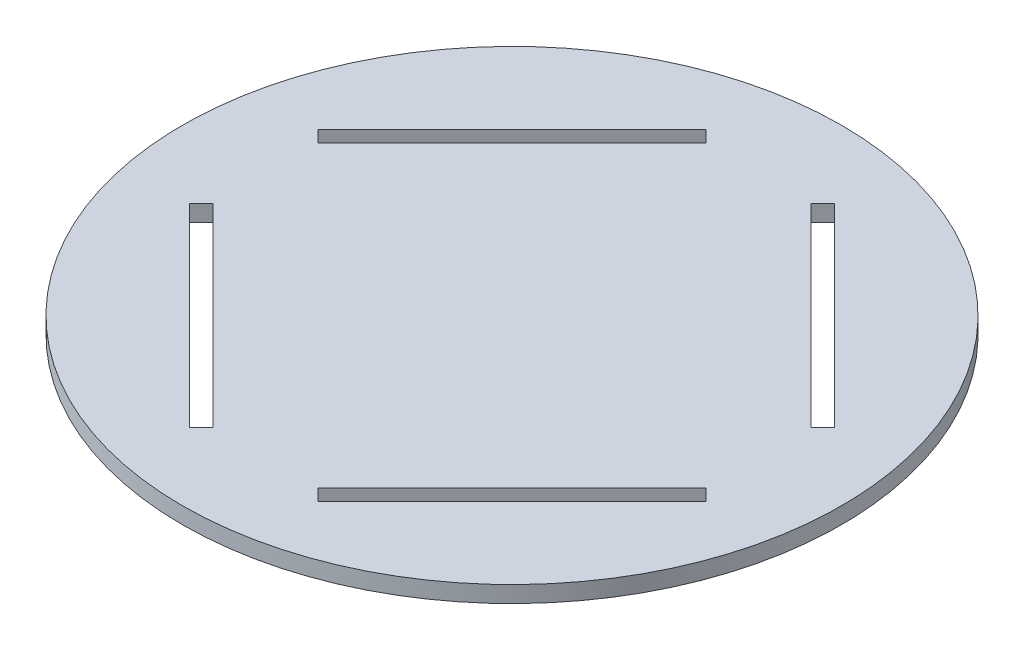
ISO-10303-21;
HEADER;
FILE_DESCRIPTION(('STEP AP214'),'2;1');
FILE_NAME('part.step','',(''),(''),'','','');
FILE_SCHEMA(('AUTOMOTIVE_DESIGN { 1 0 10303 214 1 1 1 1 }'));
ENDSEC;
DATA;
#1=APPLICATION_CONTEXT('core data for automotive mechanical design processes');
#2=APPLICATION_PROTOCOL_DEFINITION('international standard','automotive_design',2000,#1);
#3=PRODUCT_CONTEXT('',#1,'mechanical');
#4=PRODUCT('Part','Part','',(#3));
#5=PRODUCT_RELATED_PRODUCT_CATEGORY('part','',(#4));
#6=PRODUCT_DEFINITION_FORMATION('','',#4);
#7=PRODUCT_DEFINITION_CONTEXT('part definition',#1,'design');
#8=PRODUCT_DEFINITION('design','',#6,#7);
#9=PRODUCT_DEFINITION_SHAPE('','',#8);
#10=(LENGTH_UNIT() NAMED_UNIT(*) SI_UNIT(.MILLI.,.METRE.));
#11=(NAMED_UNIT(*) PLANE_ANGLE_UNIT() SI_UNIT($,.RADIAN.));
#12=(NAMED_UNIT(*) SI_UNIT($,.STERADIAN.) SOLID_ANGLE_UNIT());
#13=UNCERTAINTY_MEASURE_WITH_UNIT(LENGTH_MEASURE(1.E-05),#10,'distance_accuracy_value','');
#14=(GEOMETRIC_REPRESENTATION_CONTEXT(3) GLOBAL_UNCERTAINTY_ASSIGNED_CONTEXT((#13)) GLOBAL_UNIT_ASSIGNED_CONTEXT((#10,
#11,#12)) REPRESENTATION_CONTEXT('',''));
#15=CARTESIAN_POINT('',(0.,0.,0.));
#16=DIRECTION('',(0.,0.,1.));
#17=DIRECTION('',(1.,0.,0.));
#18=AXIS2_PLACEMENT_3D('',#15,#16,#17);
#19=CARTESIAN_POINT('',(0.,1.5,0.));
#20=DIRECTION('',(0.,-1.,0.));
#21=DIRECTION('',(0.,0.,-1.));
#22=AXIS2_PLACEMENT_3D('',#19,#20,#21);
#23=CYLINDRICAL_SURFACE('',#22,60.);
#24=CARTESIAN_POINT('',(0.,1.5,0.));
#25=DIRECTION('',(0.,1.,0.));
#26=DIRECTION('',(0.,0.,1.));
#27=AXIS2_PLACEMENT_3D('',#24,#25,#26);
#28=CIRCLE('',#27,60.);
#29=CARTESIAN_POINT('',(0.,1.5,60.));
#30=VERTEX_POINT('',#29);
#31=EDGE_CURVE('E13',#30,#30,#28,.T.);
#32=ORIENTED_EDGE('',*,*,#31,.F.);
#33=EDGE_LOOP('',(#32));
#34=FACE_BOUND('',#33,.T.);
#35=CARTESIAN_POINT('',(0.,-1.5,0.));
#36=DIRECTION('',(0.,1.,0.));
#37=DIRECTION('',(0.,0.,1.));
#38=AXIS2_PLACEMENT_3D('',#35,#36,#37);
#39=CIRCLE('',#38,60.);
#40=CARTESIAN_POINT('',(0.,-1.5,60.));
#41=VERTEX_POINT('',#40);
#42=EDGE_CURVE('E50',#41,#41,#39,.T.);
#43=ORIENTED_EDGE('',*,*,#42,.T.);
#44=EDGE_LOOP('',(#43));
#45=FACE_BOUND('',#44,.T.);
#46=ADVANCED_FACE('F47',(#34,#45),#23,.T.);
#47=CARTESIAN_POINT('',(0.,1.5,0.));
#48=DIRECTION('',(0.,1.,0.));
#49=DIRECTION('',(0.,0.,1.));
#50=AXIS2_PLACEMENT_3D('',#47,#48,#49);
#51=PLANE('',#50);
#52=DIRECTION('',(0.707106781186548,0.,-0.707106781186548));
#53=VECTOR('',#52,1.);
#54=CARTESIAN_POINT('',(17.6776695296636,1.5,17.6776695296636));
#55=LINE('',#54,#53);
#56=CARTESIAN_POINT('',(-11.6672618895781,1.5,47.0226009489054));
#57=VERTEX_POINT('',#56);
#58=CARTESIAN_POINT('',(-9.54594154601843,1.5,44.9012806053457));
#59=VERTEX_POINT('',#58);
#60=EDGE_CURVE('E164',#57,#59,#55,.T.);
#61=ORIENTED_EDGE('',*,*,#60,.F.);
#62=DIRECTION('',(0.707106781186548,0.,0.707106781186548));
#63=VECTOR('',#62,1.);
#64=CARTESIAN_POINT('',(-29.3449314192417,1.5,29.3449314192417));
#65=LINE('',#64,#63);
#66=CARTESIAN_POINT('',(-47.0226009489055,1.5,11.667261889578));
#67=VERTEX_POINT('',#66);
#68=EDGE_CURVE('E225',#67,#57,#65,.T.);
#69=ORIENTED_EDGE('',*,*,#68,.F.);
#70=DIRECTION('',(-0.707106781186549,0.,0.707106781186546));
#71=VECTOR('',#70,1.);
#72=CARTESIAN_POINT('',(-17.6776695296636,1.5,-17.6776695296637));
#73=LINE('',#72,#71);
#74=CARTESIAN_POINT('',(-44.9012806053458,1.5,9.54594154601835));
#75=VERTEX_POINT('',#74);
#76=EDGE_CURVE('E223',#75,#67,#73,.T.);
#77=ORIENTED_EDGE('',*,*,#76,.F.);
#78=DIRECTION('',(-0.707106781186548,0.,-0.707106781186547));
#79=VECTOR('',#78,1.);
#80=CARTESIAN_POINT('',(-27.2236110756821,1.5,27.2236110756821));
#81=LINE('',#80,#79);
#82=EDGE_CURVE('E221',#59,#75,#81,.T.);
#83=ORIENTED_EDGE('',*,*,#82,.F.);
#84=EDGE_LOOP('',(#61,#69,#77,#83));
#85=FACE_BOUND('',#84,.T.);
#86=DIRECTION('',(0.70710678118654,0.,0.707106781186555));
#87=VECTOR('',#86,1.);
#88=CARTESIAN_POINT('',(-17.6776695296638,1.5,17.6776695296635));
#89=LINE('',#88,#87);
#90=CARTESIAN_POINT('',(-47.0226009489052,1.5,-11.6672618895786));
#91=VERTEX_POINT('',#90);
#92=CARTESIAN_POINT('',(-44.9012806053456,1.5,-9.54594154601891));
#93=VERTEX_POINT('',#92);
#94=EDGE_CURVE('E219',#91,#93,#89,.T.);
#95=ORIENTED_EDGE('',*,*,#94,.F.);
#96=DIRECTION('',(-0.707106781186555,0.,0.70710678118654));
#97=VECTOR('',#96,1.);
#98=CARTESIAN_POINT('',(-29.3449314192414,1.5,-29.344931419242));
#99=LINE('',#98,#97);
#100=CARTESIAN_POINT('',(-11.6672618895775,1.5,-47.0226009489056));
#101=VERTEX_POINT('',#100);
#102=EDGE_CURVE('E217',#101,#91,#99,.T.);
#103=ORIENTED_EDGE('',*,*,#102,.F.);
#104=DIRECTION('',(-0.707106781186539,0.,-0.707106781186556));
#105=VECTOR('',#104,1.);
#106=CARTESIAN_POINT('',(17.6776695296639,1.5,-17.6776695296635));
#107=LINE('',#106,#105);
#108=CARTESIAN_POINT('',(-9.54594154601788,1.5,-44.9012806053459));
#109=VERTEX_POINT('',#108);
#110=EDGE_CURVE('E215',#109,#101,#107,.T.);
#111=ORIENTED_EDGE('',*,*,#110,.F.);
#112=DIRECTION('',(0.707106781186555,0.,-0.70710678118654));
#113=VECTOR('',#112,1.);
#114=CARTESIAN_POINT('',(-27.2236110756818,1.5,-27.2236110756824));
#115=LINE('',#114,#113);
#116=EDGE_CURVE('E191',#93,#109,#115,.T.);
#117=ORIENTED_EDGE('',*,*,#116,.F.);
#118=EDGE_LOOP('',(#95,#103,#111,#117));
#119=FACE_BOUND('',#118,.T.);
#120=DIRECTION('',(-0.707106781186545,0.,-0.70710678118655));
#121=VECTOR('',#120,1.);
#122=CARTESIAN_POINT('',(17.6776695296637,1.5,-17.6776695296636));
#123=LINE('',#122,#121);
#124=CARTESIAN_POINT('',(47.0226009489053,1.5,11.6672618895782));
#125=VERTEX_POINT('',#124);
#126=CARTESIAN_POINT('',(44.9012806053457,1.5,9.54594154601859));
#127=VERTEX_POINT('',#126);
#128=EDGE_CURVE('E257',#125,#127,#123,.T.);
#129=ORIENTED_EDGE('',*,*,#128,.F.);
#130=DIRECTION('',(0.70710678118655,0.,-0.707106781186545));
#131=VECTOR('',#130,1.);
#132=CARTESIAN_POINT('',(29.3449314192416,1.5,29.3449314192418));
#133=LINE('',#132,#131);
#134=CARTESIAN_POINT('',(11.6672618895778,1.5,47.0226009489055));
#135=VERTEX_POINT('',#134);
#136=EDGE_CURVE('E255',#135,#125,#133,.T.);
#137=ORIENTED_EDGE('',*,*,#136,.F.);
#138=DIRECTION('',(0.707106781186544,0.,0.707106781186551));
#139=VECTOR('',#138,1.);
#140=CARTESIAN_POINT('',(-17.6776695296638,1.5,17.6776695296636));
#141=LINE('',#140,#139);
#142=CARTESIAN_POINT('',(9.54594154601819,1.5,44.9012806053459));
#143=VERTEX_POINT('',#142);
#144=EDGE_CURVE('E253',#143,#135,#141,.T.);
#145=ORIENTED_EDGE('',*,*,#144,.F.);
#146=DIRECTION('',(-0.70710678118655,0.,0.707106781186545));
#147=VECTOR('',#146,1.);
#148=CARTESIAN_POINT('',(27.223611075682,1.5,27.2236110756822));
#149=LINE('',#148,#147);
#150=EDGE_CURVE('E244',#127,#143,#149,.T.);
#151=ORIENTED_EDGE('',*,*,#150,.F.);
#152=EDGE_LOOP('',(#129,#137,#145,#151));
#153=FACE_BOUND('',#152,.T.);
#154=DIRECTION('',(-0.707106781186548,0.,0.707106781186548));
#155=VECTOR('',#154,1.);
#156=CARTESIAN_POINT('',(-17.6776695296636,1.5,-17.6776695296636));
#157=LINE('',#156,#155);
#158=CARTESIAN_POINT('',(11.6672618895781,1.5,-47.0226009489054));
#159=VERTEX_POINT('',#158);
#160=CARTESIAN_POINT('',(9.54594154601843,1.5,-44.9012806053457));
#161=VERTEX_POINT('',#160);
#162=EDGE_CURVE('E289',#159,#161,#157,.T.);
#163=ORIENTED_EDGE('',*,*,#162,.F.);
#164=DIRECTION('',(-0.707106781186548,0.,-0.707106781186548));
#165=VECTOR('',#164,1.);
#166=CARTESIAN_POINT('',(29.3449314192417,1.5,-29.3449314192417));
#167=LINE('',#166,#165);
#168=CARTESIAN_POINT('',(47.0226009489055,1.5,-11.667261889578));
#169=VERTEX_POINT('',#168);
#170=EDGE_CURVE('E287',#169,#159,#167,.T.);
#171=ORIENTED_EDGE('',*,*,#170,.F.);
#172=DIRECTION('',(0.707106781186549,0.,-0.707106781186546));
#173=VECTOR('',#172,1.);
#174=CARTESIAN_POINT('',(17.6776695296636,1.5,17.6776695296637));
#175=LINE('',#174,#173);
#176=CARTESIAN_POINT('',(44.9012806053458,1.5,-9.54594154601835));
#177=VERTEX_POINT('',#176);
#178=EDGE_CURVE('E285',#177,#169,#175,.T.);
#179=ORIENTED_EDGE('',*,*,#178,.F.);
#180=DIRECTION('',(0.707106781186548,0.,0.707106781186547));
#181=VECTOR('',#180,1.);
#182=CARTESIAN_POINT('',(27.2236110756821,1.5,-27.2236110756821));
#183=LINE('',#182,#181);
#184=EDGE_CURVE('E276',#161,#177,#183,.T.);
#185=ORIENTED_EDGE('',*,*,#184,.F.);
#186=EDGE_LOOP('',(#163,#171,#179,#185));
#187=FACE_BOUND('',#186,.T.);
#188=ORIENTED_EDGE('',*,*,#31,.T.);
#189=EDGE_LOOP('',(#188));
#190=FACE_BOUND('',#189,.T.);
#191=ADVANCED_FACE('F300',(#85,#119,#153,#187,#190),#51,.T.);
#192=CARTESIAN_POINT('',(0.,-1.5,0.));
#193=DIRECTION('',(0.,1.,0.));
#194=DIRECTION('',(0.,0.,1.));
#195=AXIS2_PLACEMENT_3D('',#192,#193,#194);
#196=PLANE('',#195);
#197=DIRECTION('',(0.707106781186547,0.,0.707106781186547));
#198=VECTOR('',#197,1.);
#199=CARTESIAN_POINT('',(-11.6672618895781,-1.5,47.0226009489054));
#200=LINE('',#199,#198);
#201=CARTESIAN_POINT('',(-47.0226009489055,-1.5,11.667261889578));
#202=VERTEX_POINT('',#201);
#203=CARTESIAN_POINT('',(-11.6672618895781,-1.5,47.0226009489054));
#204=VERTEX_POINT('',#203);
#205=EDGE_CURVE('E167',#202,#204,#200,.T.);
#206=ORIENTED_EDGE('',*,*,#205,.T.);
#207=DIRECTION('',(0.707106781186548,0.,-0.707106781186548));
#208=VECTOR('',#207,1.);
#209=CARTESIAN_POINT('',(-9.54594154601844,-1.5,44.9012806053457));
#210=LINE('',#209,#208);
#211=CARTESIAN_POINT('',(-9.54594154601844,-1.5,44.9012806053457));
#212=VERTEX_POINT('',#211);
#213=EDGE_CURVE('E161',#204,#212,#210,.T.);
#214=ORIENTED_EDGE('',*,*,#213,.T.);
#215=DIRECTION('',(-0.707106781186547,0.,-0.707106781186547));
#216=VECTOR('',#215,1.);
#217=CARTESIAN_POINT('',(-9.54594154601844,-1.5,44.9012806053457));
#218=LINE('',#217,#216);
#219=CARTESIAN_POINT('',(-44.9012806053458,-1.5,9.54594154601835));
#220=VERTEX_POINT('',#219);
#221=EDGE_CURVE('E171',#212,#220,#218,.T.);
#222=ORIENTED_EDGE('',*,*,#221,.T.);
#223=DIRECTION('',(-0.707106781186549,0.,0.707106781186546));
#224=VECTOR('',#223,1.);
#225=CARTESIAN_POINT('',(-44.9012806053458,-1.5,9.54594154601835));
#226=LINE('',#225,#224);
#227=EDGE_CURVE('E176',#220,#202,#226,.T.);
#228=ORIENTED_EDGE('',*,*,#227,.T.);
#229=EDGE_LOOP('',(#206,#214,#222,#228));
#230=FACE_BOUND('',#229,.T.);
#231=DIRECTION('',(-0.707106781186555,0.,0.70710678118654));
#232=VECTOR('',#231,1.);
#233=CARTESIAN_POINT('',(-47.0226009489052,-1.5,-11.6672618895786));
#234=LINE('',#233,#232);
#235=CARTESIAN_POINT('',(-11.6672618895775,-1.5,-47.0226009489056));
#236=VERTEX_POINT('',#235);
#237=CARTESIAN_POINT('',(-47.0226009489052,-1.5,-11.6672618895786));
#238=VERTEX_POINT('',#237);
#239=EDGE_CURVE('E205',#236,#238,#234,.T.);
#240=ORIENTED_EDGE('',*,*,#239,.T.);
#241=DIRECTION('',(0.70710678118654,0.,0.707106781186555));
#242=VECTOR('',#241,1.);
#243=CARTESIAN_POINT('',(-44.9012806053456,-1.5,-9.54594154601891));
#244=LINE('',#243,#242);
#245=CARTESIAN_POINT('',(-44.9012806053456,-1.5,-9.54594154601891));
#246=VERTEX_POINT('',#245);
#247=EDGE_CURVE('E196',#238,#246,#244,.T.);
#248=ORIENTED_EDGE('',*,*,#247,.T.);
#249=DIRECTION('',(0.707106781186555,0.,-0.70710678118654));
#250=VECTOR('',#249,1.);
#251=CARTESIAN_POINT('',(-44.9012806053456,-1.5,-9.54594154601891));
#252=LINE('',#251,#250);
#253=CARTESIAN_POINT('',(-9.54594154601788,-1.5,-44.9012806053459));
#254=VERTEX_POINT('',#253);
#255=EDGE_CURVE('E199',#246,#254,#252,.T.);
#256=ORIENTED_EDGE('',*,*,#255,.T.);
#257=DIRECTION('',(-0.707106781186539,0.,-0.707106781186556));
#258=VECTOR('',#257,1.);
#259=CARTESIAN_POINT('',(-9.54594154601788,-1.5,-44.9012806053459));
#260=LINE('',#259,#258);
#261=EDGE_CURVE('E202',#254,#236,#260,.T.);
#262=ORIENTED_EDGE('',*,*,#261,.T.);
#263=EDGE_LOOP('',(#240,#248,#256,#262));
#264=FACE_BOUND('',#263,.T.);
#265=DIRECTION('',(0.70710678118655,0.,-0.707106781186545));
#266=VECTOR('',#265,1.);
#267=CARTESIAN_POINT('',(47.0226009489053,-1.5,11.6672618895782));
#268=LINE('',#267,#266);
#269=CARTESIAN_POINT('',(11.6672618895778,-1.5,47.0226009489055));
#270=VERTEX_POINT('',#269);
#271=CARTESIAN_POINT('',(47.0226009489053,-1.5,11.6672618895782));
#272=VERTEX_POINT('',#271);
#273=EDGE_CURVE('E237',#270,#272,#268,.T.);
#274=ORIENTED_EDGE('',*,*,#273,.T.);
#275=DIRECTION('',(-0.707106781186545,0.,-0.70710678118655));
#276=VECTOR('',#275,1.);
#277=CARTESIAN_POINT('',(44.9012806053457,-1.5,9.54594154601859));
#278=LINE('',#277,#276);
#279=CARTESIAN_POINT('',(44.9012806053457,-1.5,9.54594154601859));
#280=VERTEX_POINT('',#279);
#281=EDGE_CURVE('E228',#272,#280,#278,.T.);
#282=ORIENTED_EDGE('',*,*,#281,.T.);
#283=DIRECTION('',(-0.70710678118655,0.,0.707106781186545));
#284=VECTOR('',#283,1.);
#285=CARTESIAN_POINT('',(44.9012806053457,-1.5,9.54594154601859));
#286=LINE('',#285,#284);
#287=CARTESIAN_POINT('',(9.5459415460182,-1.5,44.9012806053458));
#288=VERTEX_POINT('',#287);
#289=EDGE_CURVE('E231',#280,#288,#286,.T.);
#290=ORIENTED_EDGE('',*,*,#289,.T.);
#291=DIRECTION('',(0.707106781186544,0.,0.707106781186551));
#292=VECTOR('',#291,1.);
#293=CARTESIAN_POINT('',(9.54594154601819,-1.5,44.9012806053459));
#294=LINE('',#293,#292);
#295=EDGE_CURVE('E234',#288,#270,#294,.T.);
#296=ORIENTED_EDGE('',*,*,#295,.T.);
#297=EDGE_LOOP('',(#274,#282,#290,#296));
#298=FACE_BOUND('',#297,.T.);
#299=DIRECTION('',(-0.707106781186547,0.,-0.707106781186547));
#300=VECTOR('',#299,1.);
#301=CARTESIAN_POINT('',(11.6672618895781,-1.5,-47.0226009489054));
#302=LINE('',#301,#300);
#303=CARTESIAN_POINT('',(47.0226009489055,-1.5,-11.667261889578));
#304=VERTEX_POINT('',#303);
#305=CARTESIAN_POINT('',(11.6672618895781,-1.5,-47.0226009489054));
#306=VERTEX_POINT('',#305);
#307=EDGE_CURVE('E269',#304,#306,#302,.T.);
#308=ORIENTED_EDGE('',*,*,#307,.T.);
#309=DIRECTION('',(-0.707106781186548,0.,0.707106781186548));
#310=VECTOR('',#309,1.);
#311=CARTESIAN_POINT('',(9.54594154601844,-1.5,-44.9012806053457));
#312=LINE('',#311,#310);
#313=CARTESIAN_POINT('',(9.54594154601844,-1.5,-44.9012806053457));
#314=VERTEX_POINT('',#313);
#315=EDGE_CURVE('E260',#306,#314,#312,.T.);
#316=ORIENTED_EDGE('',*,*,#315,.T.);
#317=DIRECTION('',(0.707106781186547,0.,0.707106781186547));
#318=VECTOR('',#317,1.);
#319=CARTESIAN_POINT('',(9.54594154601844,-1.5,-44.9012806053457));
#320=LINE('',#319,#318);
#321=CARTESIAN_POINT('',(44.9012806053458,-1.5,-9.54594154601835));
#322=VERTEX_POINT('',#321);
#323=EDGE_CURVE('E263',#314,#322,#320,.T.);
#324=ORIENTED_EDGE('',*,*,#323,.T.);
#325=DIRECTION('',(0.707106781186549,0.,-0.707106781186546));
#326=VECTOR('',#325,1.);
#327=CARTESIAN_POINT('',(44.9012806053458,-1.5,-9.54594154601835));
#328=LINE('',#327,#326);
#329=EDGE_CURVE('E266',#322,#304,#328,.T.);
#330=ORIENTED_EDGE('',*,*,#329,.T.);
#331=EDGE_LOOP('',(#308,#316,#324,#330));
#332=FACE_BOUND('',#331,.T.);
#333=ORIENTED_EDGE('',*,*,#42,.F.);
#334=EDGE_LOOP('',(#333));
#335=FACE_BOUND('',#334,.T.);
#336=ADVANCED_FACE('F178',(#230,#264,#298,#332,#335),#196,.F.);
#337=CARTESIAN_POINT('',(9.54594154601844,-1.5,-44.9012806053457));
#338=DIRECTION('',(-0.707106781186547,0.,-0.707106781186547));
#339=DIRECTION('',(-0.707106781186548,0.,0.707106781186548));
#340=AXIS2_PLACEMENT_3D('',#337,#338,#339);
#341=PLANE('',#340);
#342=ORIENTED_EDGE('',*,*,#162,.T.);
#343=DIRECTION('',(0.,1.,0.));
#344=VECTOR('',#343,1.);
#345=CARTESIAN_POINT('',(9.54594154601844,-1.5,-44.9012806053457));
#346=LINE('',#345,#344);
#347=EDGE_CURVE('E272',#314,#161,#346,.T.);
#348=ORIENTED_EDGE('',*,*,#347,.F.);
#349=ORIENTED_EDGE('',*,*,#315,.F.);
#350=DIRECTION('',(0.,1.,0.));
#351=VECTOR('',#350,1.);
#352=CARTESIAN_POINT('',(11.6672618895781,-1.5,-47.0226009489054));
#353=LINE('',#352,#351);
#354=EDGE_CURVE('E273',#306,#159,#353,.T.);
#355=ORIENTED_EDGE('',*,*,#354,.T.);
#356=EDGE_LOOP('',(#342,#348,#349,#355));
#357=FACE_BOUND('',#356,.T.);
#358=ADVANCED_FACE('F299',(#357),#341,.F.);
#359=CARTESIAN_POINT('',(11.6672618895781,-1.5,-47.0226009489054));
#360=DIRECTION('',(0.707106781186548,0.,-0.707106781186548));
#361=DIRECTION('',(-0.707106781186548,0.,-0.707106781186548));
#362=AXIS2_PLACEMENT_3D('',#359,#360,#361);
#363=PLANE('',#362);
#364=ORIENTED_EDGE('',*,*,#170,.T.);
#365=ORIENTED_EDGE('',*,*,#354,.F.);
#366=ORIENTED_EDGE('',*,*,#307,.F.);
#367=DIRECTION('',(0.,1.,0.));
#368=VECTOR('',#367,1.);
#369=CARTESIAN_POINT('',(47.0226009489055,-1.5,-11.667261889578));
#370=LINE('',#369,#368);
#371=EDGE_CURVE('E277',#304,#169,#370,.T.);
#372=ORIENTED_EDGE('',*,*,#371,.T.);
#373=EDGE_LOOP('',(#364,#365,#366,#372));
#374=FACE_BOUND('',#373,.T.);
#375=ADVANCED_FACE('F305',(#374),#363,.F.);
#376=CARTESIAN_POINT('',(44.9012806053458,-1.5,-9.54594154601835));
#377=DIRECTION('',(0.707106781186546,0.,0.707106781186549));
#378=DIRECTION('',(0.707106781186549,0.,-0.707106781186546));
#379=AXIS2_PLACEMENT_3D('',#376,#377,#378);
#380=PLANE('',#379);
#381=ORIENTED_EDGE('',*,*,#178,.T.);
#382=ORIENTED_EDGE('',*,*,#371,.F.);
#383=ORIENTED_EDGE('',*,*,#329,.F.);
#384=DIRECTION('',(0.,1.,0.));
#385=VECTOR('',#384,1.);
#386=CARTESIAN_POINT('',(44.9012806053458,-1.5,-9.54594154601835));
#387=LINE('',#386,#385);
#388=EDGE_CURVE('E280',#322,#177,#387,.T.);
#389=ORIENTED_EDGE('',*,*,#388,.T.);
#390=EDGE_LOOP('',(#381,#382,#383,#389));
#391=FACE_BOUND('',#390,.T.);
#392=ADVANCED_FACE('F453',(#391),#380,.F.);
#393=CARTESIAN_POINT('',(9.54594154601844,-1.5,-44.9012806053457));
#394=DIRECTION('',(-0.707106781186547,0.,0.707106781186548));
#395=DIRECTION('',(0.707106781186548,0.,0.707106781186547));
#396=AXIS2_PLACEMENT_3D('',#393,#394,#395);
#397=PLANE('',#396);
#398=ORIENTED_EDGE('',*,*,#184,.T.);
#399=ORIENTED_EDGE('',*,*,#388,.F.);
#400=ORIENTED_EDGE('',*,*,#323,.F.);
#401=ORIENTED_EDGE('',*,*,#347,.T.);
#402=EDGE_LOOP('',(#398,#399,#400,#401));
#403=FACE_BOUND('',#402,.T.);
#404=ADVANCED_FACE('F326',(#403),#397,.F.);
#405=CARTESIAN_POINT('',(44.9012806053457,-1.5,9.54594154601859));
#406=DIRECTION('',(0.70710678118655,0.,-0.707106781186545));
#407=DIRECTION('',(-0.707106781186545,0.,-0.70710678118655));
#408=AXIS2_PLACEMENT_3D('',#405,#406,#407);
#409=PLANE('',#408);
#410=ORIENTED_EDGE('',*,*,#128,.T.);
#411=DIRECTION('',(0.,1.,0.));
#412=VECTOR('',#411,1.);
#413=CARTESIAN_POINT('',(44.9012806053457,-1.5,9.54594154601859));
#414=LINE('',#413,#412);
#415=EDGE_CURVE('E240',#280,#127,#414,.T.);
#416=ORIENTED_EDGE('',*,*,#415,.F.);
#417=ORIENTED_EDGE('',*,*,#281,.F.);
#418=DIRECTION('',(0.,1.,0.));
#419=VECTOR('',#418,1.);
#420=CARTESIAN_POINT('',(47.0226009489053,-1.5,11.6672618895782));
#421=LINE('',#420,#419);
#422=EDGE_CURVE('E241',#272,#125,#421,.T.);
#423=ORIENTED_EDGE('',*,*,#422,.T.);
#424=EDGE_LOOP('',(#410,#416,#417,#423));
#425=FACE_BOUND('',#424,.T.);
#426=ADVANCED_FACE('F336',(#425),#409,.F.);
#427=CARTESIAN_POINT('',(47.0226009489053,-1.5,11.6672618895782));
#428=DIRECTION('',(0.707106781186545,0.,0.70710678118655));
#429=DIRECTION('',(0.70710678118655,0.,-0.707106781186545));
#430=AXIS2_PLACEMENT_3D('',#427,#428,#429);
#431=PLANE('',#430);
#432=ORIENTED_EDGE('',*,*,#136,.T.);
#433=ORIENTED_EDGE('',*,*,#422,.F.);
#434=ORIENTED_EDGE('',*,*,#273,.F.);
#435=DIRECTION('',(0.,1.,0.));
#436=VECTOR('',#435,1.);
#437=CARTESIAN_POINT('',(11.6672618895778,-1.5,47.0226009489055));
#438=LINE('',#437,#436);
#439=EDGE_CURVE('E245',#270,#135,#438,.T.);
#440=ORIENTED_EDGE('',*,*,#439,.T.);
#441=EDGE_LOOP('',(#432,#433,#434,#440));
#442=FACE_BOUND('',#441,.T.);
#443=ADVANCED_FACE('F341',(#442),#431,.F.);
#444=CARTESIAN_POINT('',(9.54594154601819,-1.5,44.9012806053459));
#445=DIRECTION('',(-0.707106781186551,0.,0.707106781186544));
#446=DIRECTION('',(0.707106781186544,0.,0.707106781186551));
#447=AXIS2_PLACEMENT_3D('',#444,#445,#446);
#448=PLANE('',#447);
#449=ORIENTED_EDGE('',*,*,#144,.T.);
#450=ORIENTED_EDGE('',*,*,#439,.F.);
#451=ORIENTED_EDGE('',*,*,#295,.F.);
#452=DIRECTION('',(0.,1.,0.));
#453=VECTOR('',#452,1.);
#454=CARTESIAN_POINT('',(9.54594154601819,-1.5,44.9012806053459));
#455=LINE('',#454,#453);
#456=EDGE_CURVE('E248',#288,#143,#455,.T.);
#457=ORIENTED_EDGE('',*,*,#456,.T.);
#458=EDGE_LOOP('',(#449,#450,#451,#457));
#459=FACE_BOUND('',#458,.T.);
#460=ADVANCED_FACE('F351',(#459),#448,.F.);
#461=CARTESIAN_POINT('',(44.9012806053457,-1.5,9.54594154601859));
#462=DIRECTION('',(-0.707106781186545,0.,-0.70710678118655));
#463=DIRECTION('',(-0.70710678118655,0.,0.707106781186545));
#464=AXIS2_PLACEMENT_3D('',#461,#462,#463);
#465=PLANE('',#464);
#466=ORIENTED_EDGE('',*,*,#150,.T.);
#467=ORIENTED_EDGE('',*,*,#456,.F.);
#468=ORIENTED_EDGE('',*,*,#289,.F.);
#469=ORIENTED_EDGE('',*,*,#415,.T.);
#470=EDGE_LOOP('',(#466,#467,#468,#469));
#471=FACE_BOUND('',#470,.T.);
#472=ADVANCED_FACE('F361',(#471),#465,.F.);
#473=CARTESIAN_POINT('',(-44.9012806053456,-1.5,-9.54594154601891));
#474=DIRECTION('',(-0.707106781186555,0.,0.70710678118654));
#475=DIRECTION('',(0.70710678118654,0.,0.707106781186555));
#476=AXIS2_PLACEMENT_3D('',#473,#474,#475);
#477=PLANE('',#476);
#478=ORIENTED_EDGE('',*,*,#94,.T.);
#479=DIRECTION('',(0.,1.,0.));
#480=VECTOR('',#479,1.);
#481=CARTESIAN_POINT('',(-44.9012806053456,-1.5,-9.54594154601891));
#482=LINE('',#481,#480);
#483=EDGE_CURVE('E69',#246,#93,#482,.T.);
#484=ORIENTED_EDGE('',*,*,#483,.F.);
#485=ORIENTED_EDGE('',*,*,#247,.F.);
#486=DIRECTION('',(0.,1.,0.));
#487=VECTOR('',#486,1.);
#488=CARTESIAN_POINT('',(-47.0226009489052,-1.5,-11.6672618895786));
#489=LINE('',#488,#487);
#490=EDGE_CURVE('E181',#238,#91,#489,.T.);
#491=ORIENTED_EDGE('',*,*,#490,.T.);
#492=EDGE_LOOP('',(#478,#484,#485,#491));
#493=FACE_BOUND('',#492,.T.);
#494=ADVANCED_FACE('F371',(#493),#477,.F.);
#495=CARTESIAN_POINT('',(-47.0226009489052,-1.5,-11.6672618895786));
#496=DIRECTION('',(-0.70710678118654,0.,-0.707106781186555));
#497=DIRECTION('',(-0.707106781186555,0.,0.70710678118654));
#498=AXIS2_PLACEMENT_3D('',#495,#496,#497);
#499=PLANE('',#498);
#500=ORIENTED_EDGE('',*,*,#102,.T.);
#501=ORIENTED_EDGE('',*,*,#490,.F.);
#502=ORIENTED_EDGE('',*,*,#239,.F.);
#503=DIRECTION('',(0.,1.,0.));
#504=VECTOR('',#503,1.);
#505=CARTESIAN_POINT('',(-11.6672618895775,-1.5,-47.0226009489056));
#506=LINE('',#505,#504);
#507=EDGE_CURVE('E184',#236,#101,#506,.T.);
#508=ORIENTED_EDGE('',*,*,#507,.T.);
#509=EDGE_LOOP('',(#500,#501,#502,#508));
#510=FACE_BOUND('',#509,.T.);
#511=ADVANCED_FACE('F381',(#510),#499,.F.);
#512=CARTESIAN_POINT('',(-9.54594154601788,-1.5,-44.9012806053459));
#513=DIRECTION('',(0.707106781186556,0.,-0.707106781186538));
#514=DIRECTION('',(-0.707106781186539,0.,-0.707106781186556));
#515=AXIS2_PLACEMENT_3D('',#512,#513,#514);
#516=PLANE('',#515);
#517=ORIENTED_EDGE('',*,*,#110,.T.);
#518=ORIENTED_EDGE('',*,*,#507,.F.);
#519=ORIENTED_EDGE('',*,*,#261,.F.);
#520=DIRECTION('',(0.,1.,0.));
#521=VECTOR('',#520,1.);
#522=CARTESIAN_POINT('',(-9.54594154601788,-1.5,-44.9012806053459));
#523=LINE('',#522,#521);
#524=EDGE_CURVE('E210',#254,#109,#523,.T.);
#525=ORIENTED_EDGE('',*,*,#524,.T.);
#526=EDGE_LOOP('',(#517,#518,#519,#525));
#527=FACE_BOUND('',#526,.T.);
#528=ADVANCED_FACE('F391',(#527),#516,.F.);
#529=CARTESIAN_POINT('',(-44.9012806053456,-1.5,-9.54594154601891));
#530=DIRECTION('',(0.70710678118654,0.,0.707106781186555));
#531=DIRECTION('',(0.707106781186555,0.,-0.70710678118654));
#532=AXIS2_PLACEMENT_3D('',#529,#530,#531);
#533=PLANE('',#532);
#534=ORIENTED_EDGE('',*,*,#116,.T.);
#535=ORIENTED_EDGE('',*,*,#524,.F.);
#536=ORIENTED_EDGE('',*,*,#255,.F.);
#537=ORIENTED_EDGE('',*,*,#483,.T.);
#538=EDGE_LOOP('',(#534,#535,#536,#537));
#539=FACE_BOUND('',#538,.T.);
#540=ADVANCED_FACE('F401',(#539),#533,.F.);
#541=CARTESIAN_POINT('',(-9.54594154601844,-1.5,44.9012806053457));
#542=DIRECTION('',(0.707106781186547,0.,0.707106781186547));
#543=DIRECTION('',(0.707106781186548,0.,-0.707106781186548));
#544=AXIS2_PLACEMENT_3D('',#541,#542,#543);
#545=PLANE('',#544);
#546=ORIENTED_EDGE('',*,*,#60,.T.);
#547=DIRECTION('',(0.,1.,0.));
#548=VECTOR('',#547,1.);
#549=CARTESIAN_POINT('',(-9.54594154601844,-1.5,44.9012806053457));
#550=LINE('',#549,#548);
#551=EDGE_CURVE('E61',#212,#59,#550,.T.);
#552=ORIENTED_EDGE('',*,*,#551,.F.);
#553=ORIENTED_EDGE('',*,*,#213,.F.);
#554=DIRECTION('',(0.,1.,0.));
#555=VECTOR('',#554,1.);
#556=CARTESIAN_POINT('',(-11.6672618895781,-1.5,47.0226009489054));
#557=LINE('',#556,#555);
#558=EDGE_CURVE('E189',#204,#57,#557,.T.);
#559=ORIENTED_EDGE('',*,*,#558,.T.);
#560=EDGE_LOOP('',(#546,#552,#553,#559));
#561=FACE_BOUND('',#560,.T.);
#562=ADVANCED_FACE('F158',(#561),#545,.F.);
#563=CARTESIAN_POINT('',(-11.6672618895781,-1.5,47.0226009489054));
#564=DIRECTION('',(-0.707106781186548,0.,0.707106781186548));
#565=DIRECTION('',(0.707106781186548,0.,0.707106781186548));
#566=AXIS2_PLACEMENT_3D('',#563,#564,#565);
#567=PLANE('',#566);
#568=ORIENTED_EDGE('',*,*,#68,.T.);
#569=ORIENTED_EDGE('',*,*,#558,.F.);
#570=ORIENTED_EDGE('',*,*,#205,.F.);
#571=DIRECTION('',(0.,1.,0.));
#572=VECTOR('',#571,1.);
#573=CARTESIAN_POINT('',(-47.0226009489055,-1.5,11.667261889578));
#574=LINE('',#573,#572);
#575=EDGE_CURVE('E192',#202,#67,#574,.T.);
#576=ORIENTED_EDGE('',*,*,#575,.T.);
#577=EDGE_LOOP('',(#568,#569,#570,#576));
#578=FACE_BOUND('',#577,.T.);
#579=ADVANCED_FACE('F419',(#578),#567,.F.);
#580=CARTESIAN_POINT('',(-44.9012806053458,-1.5,9.54594154601835));
#581=DIRECTION('',(-0.707106781186546,0.,-0.707106781186549));
#582=DIRECTION('',(-0.707106781186549,0.,0.707106781186546));
#583=AXIS2_PLACEMENT_3D('',#580,#581,#582);
#584=PLANE('',#583);
#585=ORIENTED_EDGE('',*,*,#76,.T.);
#586=ORIENTED_EDGE('',*,*,#575,.F.);
#587=ORIENTED_EDGE('',*,*,#227,.F.);
#588=DIRECTION('',(0.,1.,0.));
#589=VECTOR('',#588,1.);
#590=CARTESIAN_POINT('',(-44.9012806053458,-1.5,9.54594154601835));
#591=LINE('',#590,#589);
#592=EDGE_CURVE('E166',#220,#75,#591,.T.);
#593=ORIENTED_EDGE('',*,*,#592,.T.);
#594=EDGE_LOOP('',(#585,#586,#587,#593));
#595=FACE_BOUND('',#594,.T.);
#596=ADVANCED_FACE('F428',(#595),#584,.F.);
#597=CARTESIAN_POINT('',(-9.54594154601844,-1.5,44.9012806053457));
#598=DIRECTION('',(0.707106781186547,0.,-0.707106781186548));
#599=DIRECTION('',(-0.707106781186548,0.,-0.707106781186547));
#600=AXIS2_PLACEMENT_3D('',#597,#598,#599);
#601=PLANE('',#600);
#602=ORIENTED_EDGE('',*,*,#82,.T.);
#603=ORIENTED_EDGE('',*,*,#592,.F.);
#604=ORIENTED_EDGE('',*,*,#221,.F.);
#605=ORIENTED_EDGE('',*,*,#551,.T.);
#606=EDGE_LOOP('',(#602,#603,#604,#605));
#607=FACE_BOUND('',#606,.T.);
#608=ADVANCED_FACE('F172',(#607),#601,.F.);
#609=CLOSED_SHELL('',(#46,#191,#336,#358,#375,#392,#404,#426,#443,#460,#472,#494,#511,#528,#540,
#562,#579,#596,#608));
#610=MANIFOLD_SOLID_BREP('B2',#609);
#611=ADVANCED_BREP_SHAPE_REPRESENTATION('',(#18,#610),#14);
#612=SHAPE_DEFINITION_REPRESENTATION(#9,#611);
ENDSEC;
END-ISO-10303-21;
